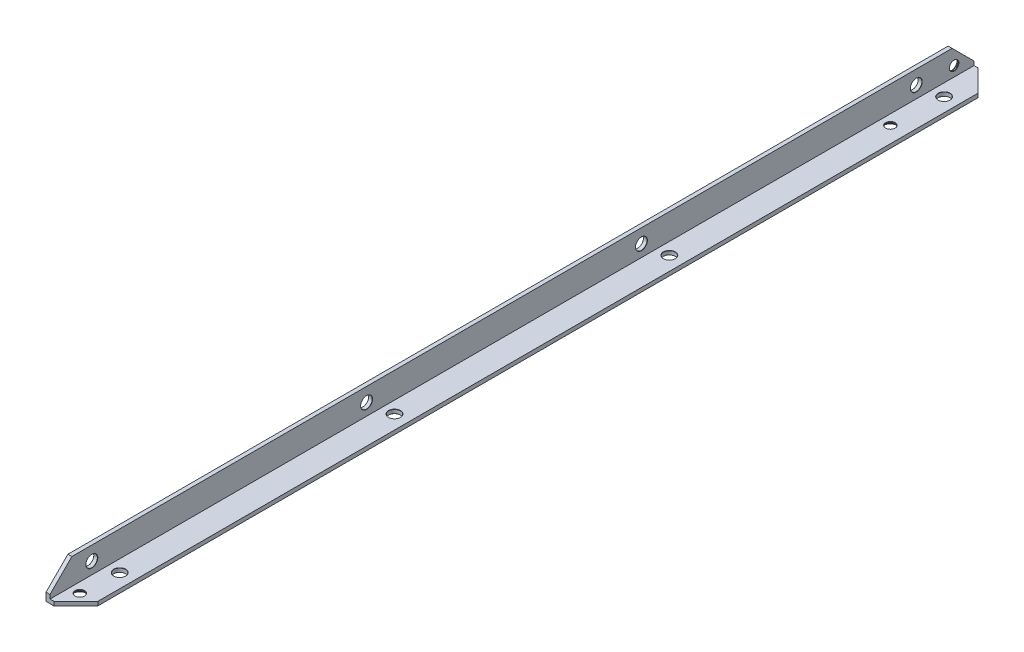
ISO-10303-21;
HEADER;
FILE_DESCRIPTION(('STEP AP214'),'2;1');
FILE_NAME('part.step','',(''),(''),'','','');
FILE_SCHEMA(('AUTOMOTIVE_DESIGN { 1 0 10303 214 1 1 1 1 }'));
ENDSEC;
DATA;
#1=APPLICATION_CONTEXT('core data for automotive mechanical design processes');
#2=APPLICATION_PROTOCOL_DEFINITION('international standard','automotive_design',2000,#1);
#3=PRODUCT_CONTEXT('',#1,'mechanical');
#4=PRODUCT('Part','Part','',(#3));
#5=PRODUCT_RELATED_PRODUCT_CATEGORY('part','',(#4));
#6=PRODUCT_DEFINITION_FORMATION('','',#4);
#7=PRODUCT_DEFINITION_CONTEXT('part definition',#1,'design');
#8=PRODUCT_DEFINITION('design','',#6,#7);
#9=PRODUCT_DEFINITION_SHAPE('','',#8);
#10=(LENGTH_UNIT() NAMED_UNIT(*) SI_UNIT(.MILLI.,.METRE.));
#11=(NAMED_UNIT(*) PLANE_ANGLE_UNIT() SI_UNIT($,.RADIAN.));
#12=(NAMED_UNIT(*) SI_UNIT($,.STERADIAN.) SOLID_ANGLE_UNIT());
#13=UNCERTAINTY_MEASURE_WITH_UNIT(LENGTH_MEASURE(1.E-05),#10,'distance_accuracy_value','');
#14=(GEOMETRIC_REPRESENTATION_CONTEXT(3) GLOBAL_UNCERTAINTY_ASSIGNED_CONTEXT((#13)) GLOBAL_UNIT_ASSIGNED_CONTEXT((#10,
#11,#12)) REPRESENTATION_CONTEXT('',''));
#15=CARTESIAN_POINT('',(0.,0.,0.));
#16=DIRECTION('',(0.,0.,1.));
#17=DIRECTION('',(1.,0.,0.));
#18=AXIS2_PLACEMENT_3D('',#15,#16,#17);
#19=CARTESIAN_POINT('',(15.,0.,464.));
#20=DIRECTION('',(0.,1.,0.));
#21=DIRECTION('',(-1.,0.,0.));
#22=AXIS2_PLACEMENT_3D('',#19,#20,#21);
#23=PLANE('',#22);
#24=CARTESIAN_POINT('',(8.00000000000016,0.,435.));
#25=DIRECTION('',(0.,-1.,0.));
#26=DIRECTION('',(0.,0.,-1.));
#27=AXIS2_PLACEMENT_3D('',#24,#25,#26);
#28=CIRCLE('',#27,3.);
#29=CARTESIAN_POINT('',(8.00000000000016,0.,432.));
#30=VERTEX_POINT('',#29);
#31=EDGE_CURVE('E288',#30,#30,#28,.T.);
#32=ORIENTED_EDGE('',*,*,#31,.F.);
#33=EDGE_LOOP('',(#32));
#34=FACE_BOUND('',#33,.T.);
#35=CARTESIAN_POINT('',(7.,0.,454.));
#36=DIRECTION('',(0.,-1.,0.));
#37=DIRECTION('',(0.,0.,-1.));
#38=AXIS2_PLACEMENT_3D('',#35,#36,#37);
#39=CIRCLE('',#38,3.7);
#40=CARTESIAN_POINT('',(7.,0.,450.3));
#41=VERTEX_POINT('',#40);
#42=EDGE_CURVE('E216',#41,#41,#39,.T.);
#43=ORIENTED_EDGE('',*,*,#42,.F.);
#44=EDGE_LOOP('',(#43));
#45=FACE_BOUND('',#44,.T.);
#46=CARTESIAN_POINT('',(7.,0.,47.));
#47=DIRECTION('',(0.,-1.,0.));
#48=DIRECTION('',(0.,0.,-1.));
#49=AXIS2_PLACEMENT_3D('',#46,#47,#48);
#50=CIRCLE('',#49,3.7);
#51=CARTESIAN_POINT('',(7.,0.,43.3));
#52=VERTEX_POINT('',#51);
#53=EDGE_CURVE('E204',#52,#52,#50,.T.);
#54=ORIENTED_EDGE('',*,*,#53,.F.);
#55=EDGE_LOOP('',(#54));
#56=FACE_BOUND('',#55,.T.);
#57=DIRECTION('',(1.,0.,0.));
#58=VECTOR('',#57,1.);
#59=CARTESIAN_POINT('',(15.,0.,0.));
#60=LINE('',#59,#58);
#61=CARTESIAN_POINT('',(0.,0.,0.));
#62=VERTEX_POINT('',#61);
#63=CARTESIAN_POINT('',(3.99999999999999,0.,0.));
#64=VERTEX_POINT('',#63);
#65=EDGE_CURVE('E142',#62,#64,#60,.T.);
#66=ORIENTED_EDGE('',*,*,#65,.T.);
#67=DIRECTION('',(0.707106781186547,0.,0.707106781186547));
#68=VECTOR('',#67,1.);
#69=CARTESIAN_POINT('',(15.,0.,11.));
#70=LINE('',#69,#68);
#71=CARTESIAN_POINT('',(15.,0.,10.9999999999999));
#72=VERTEX_POINT('',#71);
#73=EDGE_CURVE('E187',#64,#72,#70,.T.);
#74=ORIENTED_EDGE('',*,*,#73,.T.);
#75=DIRECTION('',(0.,0.,-1.));
#76=VECTOR('',#75,1.);
#77=CARTESIAN_POINT('',(15.,0.,464.));
#78=LINE('',#77,#76);
#79=CARTESIAN_POINT('',(15.,0.,453.));
#80=VERTEX_POINT('',#79);
#81=EDGE_CURVE('E159',#80,#72,#78,.T.);
#82=ORIENTED_EDGE('',*,*,#81,.F.);
#83=DIRECTION('',(0.707106781186547,0.,-0.707106781186547));
#84=VECTOR('',#83,1.);
#85=CARTESIAN_POINT('',(3.99999999999999,0.,464.));
#86=LINE('',#85,#84);
#87=CARTESIAN_POINT('',(3.99999999999999,0.,464.));
#88=VERTEX_POINT('',#87);
#89=EDGE_CURVE('E46',#80,#88,#86,.F.);
#90=ORIENTED_EDGE('',*,*,#89,.T.);
#91=DIRECTION('',(1.,0.,0.));
#92=VECTOR('',#91,1.);
#93=CARTESIAN_POINT('',(15.,0.,464.));
#94=LINE('',#93,#92);
#95=CARTESIAN_POINT('',(0.,0.,464.));
#96=VERTEX_POINT('',#95);
#97=EDGE_CURVE('E118',#96,#88,#94,.T.);
#98=ORIENTED_EDGE('',*,*,#97,.F.);
#99=DIRECTION('',(0.,0.,-1.));
#100=VECTOR('',#99,1.);
#101=CARTESIAN_POINT('',(0.,0.,464.));
#102=LINE('',#101,#100);
#103=EDGE_CURVE('E138',#96,#62,#102,.T.);
#104=ORIENTED_EDGE('',*,*,#103,.T.);
#105=EDGE_LOOP('',(#66,#74,#82,#90,#98,#104));
#106=FACE_BOUND('',#105,.T.);
#107=CARTESIAN_POINT('',(8.00000000000016,0.,297.));
#108=DIRECTION('',(0.,-1.,0.));
#109=DIRECTION('',(0.,0.,-1.));
#110=AXIS2_PLACEMENT_3D('',#107,#108,#109);
#111=CIRCLE('',#110,3.);
#112=CARTESIAN_POINT('',(8.00000000000016,0.,294.));
#113=VERTEX_POINT('',#112);
#114=EDGE_CURVE('E300',#113,#113,#111,.T.);
#115=ORIENTED_EDGE('',*,*,#114,.F.);
#116=EDGE_LOOP('',(#115));
#117=FACE_BOUND('',#116,.T.);
#118=CARTESIAN_POINT('',(8.00000000000015,0.,159.));
#119=DIRECTION('',(0.,-1.,0.));
#120=DIRECTION('',(0.,0.,-1.));
#121=AXIS2_PLACEMENT_3D('',#118,#119,#120);
#122=CIRCLE('',#121,3.);
#123=CARTESIAN_POINT('',(8.00000000000015,0.,156.));
#124=VERTEX_POINT('',#123);
#125=EDGE_CURVE('E312',#124,#124,#122,.T.);
#126=ORIENTED_EDGE('',*,*,#125,.F.);
#127=EDGE_LOOP('',(#126));
#128=FACE_BOUND('',#127,.T.);
#129=CARTESIAN_POINT('',(8.0000000000001,0.,21.0000000000003));
#130=DIRECTION('',(0.,-1.,0.));
#131=DIRECTION('',(0.,0.,-1.));
#132=AXIS2_PLACEMENT_3D('',#129,#130,#131);
#133=CIRCLE('',#132,3.);
#134=CARTESIAN_POINT('',(8.0000000000001,0.,18.0000000000003));
#135=VERTEX_POINT('',#134);
#136=EDGE_CURVE('E324',#135,#135,#133,.T.);
#137=ORIENTED_EDGE('',*,*,#136,.F.);
#138=EDGE_LOOP('',(#137));
#139=FACE_BOUND('',#138,.T.);
#140=ADVANCED_FACE('F31',(#34,#45,#56,#106,#117,#128,#139),#23,.F.);
#141=CARTESIAN_POINT('',(0.,0.,464.));
#142=DIRECTION('',(1.,0.,0.));
#143=DIRECTION('',(0.,0.,-1.));
#144=AXIS2_PLACEMENT_3D('',#141,#142,#143);
#145=PLANE('',#144);
#146=CARTESIAN_POINT('',(0.,7.99999999999996,167.));
#147=DIRECTION('',(-1.,0.,0.));
#148=DIRECTION('',(0.,0.,1.));
#149=AXIS2_PLACEMENT_3D('',#146,#147,#148);
#150=CIRCLE('',#149,3.);
#151=CARTESIAN_POINT('',(0.,7.99999999999996,170.));
#152=VERTEX_POINT('',#151);
#153=EDGE_CURVE('E264',#152,#152,#150,.T.);
#154=ORIENTED_EDGE('',*,*,#153,.F.);
#155=EDGE_LOOP('',(#154));
#156=FACE_BOUND('',#155,.T.);
#157=CARTESIAN_POINT('',(0.,7.99999999999996,443.));
#158=DIRECTION('',(-1.,0.,0.));
#159=DIRECTION('',(0.,0.,1.));
#160=AXIS2_PLACEMENT_3D('',#157,#158,#159);
#161=CIRCLE('',#160,3.);
#162=CARTESIAN_POINT('',(0.,7.99999999999996,446.));
#163=VERTEX_POINT('',#162);
#164=EDGE_CURVE('E240',#163,#163,#161,.T.);
#165=ORIENTED_EDGE('',*,*,#164,.F.);
#166=EDGE_LOOP('',(#165));
#167=FACE_BOUND('',#166,.T.);
#168=CARTESIAN_POINT('',(0.,7.00000000001343,9.99999999999908));
#169=DIRECTION('',(-1.,0.,0.));
#170=DIRECTION('',(0.,0.,1.));
#171=AXIS2_PLACEMENT_3D('',#168,#169,#170);
#172=CIRCLE('',#171,3.7);
#173=CARTESIAN_POINT('',(0.,7.00000000001343,13.6999999999991));
#174=VERTEX_POINT('',#173);
#175=EDGE_CURVE('E228',#174,#174,#172,.T.);
#176=ORIENTED_EDGE('',*,*,#175,.F.);
#177=EDGE_LOOP('',(#176));
#178=FACE_BOUND('',#177,.T.);
#179=DIRECTION('',(0.,0.,-1.));
#180=VECTOR('',#179,1.);
#181=CARTESIAN_POINT('',(0.,15.,464.));
#182=LINE('',#181,#180);
#183=CARTESIAN_POINT('',(0.,15.,453.));
#184=VERTEX_POINT('',#183);
#185=CARTESIAN_POINT('',(0.,15.,11.0000000000001));
#186=VERTEX_POINT('',#185);
#187=EDGE_CURVE('E153',#184,#186,#182,.T.);
#188=ORIENTED_EDGE('',*,*,#187,.T.);
#189=DIRECTION('',(0.,-0.707106781186548,-0.707106781186547));
#190=VECTOR('',#189,1.);
#191=CARTESIAN_POINT('',(0.,15.,11.));
#192=LINE('',#191,#190);
#193=CARTESIAN_POINT('',(0.,3.99999999999998,0.));
#194=VERTEX_POINT('',#193);
#195=EDGE_CURVE('E169',#186,#194,#192,.T.);
#196=ORIENTED_EDGE('',*,*,#195,.T.);
#197=DIRECTION('',(0.,-1.,0.));
#198=VECTOR('',#197,1.);
#199=CARTESIAN_POINT('',(0.,0.,0.));
#200=LINE('',#199,#198);
#201=EDGE_CURVE('E149',#194,#62,#200,.T.);
#202=ORIENTED_EDGE('',*,*,#201,.T.);
#203=ORIENTED_EDGE('',*,*,#103,.F.);
#204=DIRECTION('',(0.,-1.,0.));
#205=VECTOR('',#204,1.);
#206=CARTESIAN_POINT('',(0.,0.,464.));
#207=LINE('',#206,#205);
#208=CARTESIAN_POINT('',(0.,3.99999999999999,464.));
#209=VERTEX_POINT('',#208);
#210=EDGE_CURVE('E136',#209,#96,#207,.T.);
#211=ORIENTED_EDGE('',*,*,#210,.F.);
#212=DIRECTION('',(0.,-0.707106781186548,0.707106781186547));
#213=VECTOR('',#212,1.);
#214=CARTESIAN_POINT('',(0.,3.99999999999998,464.));
#215=LINE('',#214,#213);
#216=EDGE_CURVE('E167',#209,#184,#215,.F.);
#217=ORIENTED_EDGE('',*,*,#216,.T.);
#218=EDGE_LOOP('',(#188,#196,#202,#203,#211,#217));
#219=FACE_BOUND('',#218,.T.);
#220=CARTESIAN_POINT('',(0.,7.99999999999996,305.));
#221=DIRECTION('',(-1.,0.,0.));
#222=DIRECTION('',(0.,0.,1.));
#223=AXIS2_PLACEMENT_3D('',#220,#221,#222);
#224=CIRCLE('',#223,3.);
#225=CARTESIAN_POINT('',(0.,7.99999999999996,308.));
#226=VERTEX_POINT('',#225);
#227=EDGE_CURVE('E252',#226,#226,#224,.T.);
#228=ORIENTED_EDGE('',*,*,#227,.F.);
#229=EDGE_LOOP('',(#228));
#230=FACE_BOUND('',#229,.T.);
#231=CARTESIAN_POINT('',(0.,7.99999999999996,29.0000000000001));
#232=DIRECTION('',(-1.,0.,0.));
#233=DIRECTION('',(0.,0.,1.));
#234=AXIS2_PLACEMENT_3D('',#231,#232,#233);
#235=CIRCLE('',#234,3.);
#236=CARTESIAN_POINT('',(0.,7.99999999999996,32.0000000000001));
#237=VERTEX_POINT('',#236);
#238=EDGE_CURVE('E276',#237,#237,#235,.T.);
#239=ORIENTED_EDGE('',*,*,#238,.F.);
#240=EDGE_LOOP('',(#239));
#241=FACE_BOUND('',#240,.T.);
#242=ADVANCED_FACE('F192',(#156,#167,#178,#219,#230,#241),#145,.F.);
#243=CARTESIAN_POINT('',(15.,2.,464.));
#244=DIRECTION('',(-1.,0.,0.));
#245=DIRECTION('',(0.,-1.,0.));
#246=AXIS2_PLACEMENT_3D('',#243,#244,#245);
#247=PLANE('',#246);
#248=ORIENTED_EDGE('',*,*,#81,.T.);
#249=DIRECTION('',(0.,1.,0.));
#250=VECTOR('',#249,1.);
#251=CARTESIAN_POINT('',(15.,2.,11.));
#252=LINE('',#251,#250);
#253=CARTESIAN_POINT('',(15.,2.,11.0000000000001));
#254=VERTEX_POINT('',#253);
#255=EDGE_CURVE('E180',#72,#254,#252,.T.);
#256=ORIENTED_EDGE('',*,*,#255,.T.);
#257=DIRECTION('',(0.,0.,-1.));
#258=VECTOR('',#257,1.);
#259=CARTESIAN_POINT('',(15.,2.,464.));
#260=LINE('',#259,#258);
#261=CARTESIAN_POINT('',(15.,2.,453.));
#262=VERTEX_POINT('',#261);
#263=EDGE_CURVE('E129',#262,#254,#260,.T.);
#264=ORIENTED_EDGE('',*,*,#263,.F.);
#265=DIRECTION('',(0.,-1.,0.));
#266=VECTOR('',#265,1.);
#267=CARTESIAN_POINT('',(15.,2.,453.));
#268=LINE('',#267,#266);
#269=EDGE_CURVE('E178',#262,#80,#268,.T.);
#270=ORIENTED_EDGE('',*,*,#269,.T.);
#271=EDGE_LOOP('',(#248,#256,#264,#270));
#272=FACE_BOUND('',#271,.T.);
#273=ADVANCED_FACE('F358',(#272),#247,.F.);
#274=CARTESIAN_POINT('',(2.,2.,464.));
#275=DIRECTION('',(0.,-1.,0.));
#276=DIRECTION('',(0.,0.,-1.));
#277=AXIS2_PLACEMENT_3D('',#274,#275,#276);
#278=PLANE('',#277);
#279=CARTESIAN_POINT('',(8.0000000000001,2.,21.0000000000003));
#280=DIRECTION('',(0.,-1.,0.));
#281=DIRECTION('',(0.,0.,-1.));
#282=AXIS2_PLACEMENT_3D('',#279,#280,#281);
#283=CIRCLE('',#282,3.);
#284=CARTESIAN_POINT('',(8.0000000000001,2.,18.0000000000003));
#285=VERTEX_POINT('',#284);
#286=EDGE_CURVE('E327',#285,#285,#283,.T.);
#287=ORIENTED_EDGE('',*,*,#286,.T.);
#288=EDGE_LOOP('',(#287));
#289=FACE_BOUND('',#288,.T.);
#290=CARTESIAN_POINT('',(8.00000000000015,2.,159.));
#291=DIRECTION('',(0.,-1.,0.));
#292=DIRECTION('',(0.,0.,-1.));
#293=AXIS2_PLACEMENT_3D('',#290,#291,#292);
#294=CIRCLE('',#293,3.);
#295=CARTESIAN_POINT('',(8.00000000000015,2.,156.));
#296=VERTEX_POINT('',#295);
#297=EDGE_CURVE('E315',#296,#296,#294,.T.);
#298=ORIENTED_EDGE('',*,*,#297,.T.);
#299=EDGE_LOOP('',(#298));
#300=FACE_BOUND('',#299,.T.);
#301=CARTESIAN_POINT('',(8.00000000000016,2.,297.));
#302=DIRECTION('',(0.,-1.,0.));
#303=DIRECTION('',(0.,0.,-1.));
#304=AXIS2_PLACEMENT_3D('',#301,#302,#303);
#305=CIRCLE('',#304,3.);
#306=CARTESIAN_POINT('',(8.00000000000016,2.,294.));
#307=VERTEX_POINT('',#306);
#308=EDGE_CURVE('E303',#307,#307,#305,.T.);
#309=ORIENTED_EDGE('',*,*,#308,.T.);
#310=EDGE_LOOP('',(#309));
#311=FACE_BOUND('',#310,.T.);
#312=CARTESIAN_POINT('',(8.00000000000016,2.,435.));
#313=DIRECTION('',(0.,-1.,0.));
#314=DIRECTION('',(0.,0.,-1.));
#315=AXIS2_PLACEMENT_3D('',#312,#313,#314);
#316=CIRCLE('',#315,3.);
#317=CARTESIAN_POINT('',(8.00000000000016,2.,432.));
#318=VERTEX_POINT('',#317);
#319=EDGE_CURVE('E291',#318,#318,#316,.T.);
#320=ORIENTED_EDGE('',*,*,#319,.T.);
#321=EDGE_LOOP('',(#320));
#322=FACE_BOUND('',#321,.T.);
#323=CARTESIAN_POINT('',(7.,2.,454.));
#324=DIRECTION('',(0.,-1.,0.));
#325=DIRECTION('',(0.,0.,-1.));
#326=AXIS2_PLACEMENT_3D('',#323,#324,#325);
#327=CIRCLE('',#326,2.4);
#328=CARTESIAN_POINT('',(7.,2.,451.6));
#329=VERTEX_POINT('',#328);
#330=EDGE_CURVE('E219',#329,#329,#327,.T.);
#331=ORIENTED_EDGE('',*,*,#330,.T.);
#332=EDGE_LOOP('',(#331));
#333=FACE_BOUND('',#332,.T.);
#334=CARTESIAN_POINT('',(7.,2.,47.));
#335=DIRECTION('',(0.,-1.,0.));
#336=DIRECTION('',(0.,0.,-1.));
#337=AXIS2_PLACEMENT_3D('',#334,#335,#336);
#338=CIRCLE('',#337,2.4);
#339=CARTESIAN_POINT('',(7.,2.,44.6));
#340=VERTEX_POINT('',#339);
#341=EDGE_CURVE('E207',#340,#340,#338,.T.);
#342=ORIENTED_EDGE('',*,*,#341,.T.);
#343=EDGE_LOOP('',(#342));
#344=FACE_BOUND('',#343,.T.);
#345=ORIENTED_EDGE('',*,*,#263,.T.);
#346=DIRECTION('',(-0.707106781186548,0.,-0.707106781186548));
#347=VECTOR('',#346,1.);
#348=CARTESIAN_POINT('',(15.,2.,11.));
#349=LINE('',#348,#347);
#350=CARTESIAN_POINT('',(3.99999999999999,2.,0.));
#351=VERTEX_POINT('',#350);
#352=EDGE_CURVE('E184',#254,#351,#349,.T.);
#353=ORIENTED_EDGE('',*,*,#352,.T.);
#354=DIRECTION('',(-1.,0.,0.));
#355=VECTOR('',#354,1.);
#356=CARTESIAN_POINT('',(2.,2.,0.));
#357=LINE('',#356,#355);
#358=CARTESIAN_POINT('',(2.,2.,0.));
#359=VERTEX_POINT('',#358);
#360=EDGE_CURVE('E125',#351,#359,#357,.T.);
#361=ORIENTED_EDGE('',*,*,#360,.T.);
#362=DIRECTION('',(0.,0.,-1.));
#363=VECTOR('',#362,1.);
#364=CARTESIAN_POINT('',(2.,2.,464.));
#365=LINE('',#364,#363);
#366=CARTESIAN_POINT('',(2.,2.,464.));
#367=VERTEX_POINT('',#366);
#368=EDGE_CURVE('E121',#367,#359,#365,.T.);
#369=ORIENTED_EDGE('',*,*,#368,.F.);
#370=DIRECTION('',(-1.,0.,0.));
#371=VECTOR('',#370,1.);
#372=CARTESIAN_POINT('',(2.,2.,464.));
#373=LINE('',#372,#371);
#374=CARTESIAN_POINT('',(3.99999999999999,2.,464.));
#375=VERTEX_POINT('',#374);
#376=EDGE_CURVE('E110',#375,#367,#373,.T.);
#377=ORIENTED_EDGE('',*,*,#376,.F.);
#378=DIRECTION('',(-0.707106781186548,0.,0.707106781186548));
#379=VECTOR('',#378,1.);
#380=CARTESIAN_POINT('',(3.99999999999999,2.,464.));
#381=LINE('',#380,#379);
#382=EDGE_CURVE('E54',#375,#262,#381,.F.);
#383=ORIENTED_EDGE('',*,*,#382,.T.);
#384=EDGE_LOOP('',(#345,#353,#361,#369,#377,#383));
#385=FACE_BOUND('',#384,.T.);
#386=ADVANCED_FACE('F123',(#289,#300,#311,#322,#333,#344,#385),#278,.F.);
#387=CARTESIAN_POINT('',(2.,15.,464.));
#388=DIRECTION('',(-1.,0.,0.));
#389=DIRECTION('',(0.,-1.,0.));
#390=AXIS2_PLACEMENT_3D('',#387,#388,#389);
#391=PLANE('',#390);
#392=CARTESIAN_POINT('',(2.,7.99999999999996,29.0000000000001));
#393=DIRECTION('',(-1.,0.,0.));
#394=DIRECTION('',(0.,0.,1.));
#395=AXIS2_PLACEMENT_3D('',#392,#393,#394);
#396=CIRCLE('',#395,3.);
#397=CARTESIAN_POINT('',(2.,7.99999999999996,32.0000000000001));
#398=VERTEX_POINT('',#397);
#399=EDGE_CURVE('E279',#398,#398,#396,.T.);
#400=ORIENTED_EDGE('',*,*,#399,.T.);
#401=EDGE_LOOP('',(#400));
#402=FACE_BOUND('',#401,.T.);
#403=CARTESIAN_POINT('',(2.,7.99999999999996,167.));
#404=DIRECTION('',(-1.,0.,0.));
#405=DIRECTION('',(0.,0.,1.));
#406=AXIS2_PLACEMENT_3D('',#403,#404,#405);
#407=CIRCLE('',#406,3.);
#408=CARTESIAN_POINT('',(2.,7.99999999999996,170.));
#409=VERTEX_POINT('',#408);
#410=EDGE_CURVE('E267',#409,#409,#407,.T.);
#411=ORIENTED_EDGE('',*,*,#410,.T.);
#412=EDGE_LOOP('',(#411));
#413=FACE_BOUND('',#412,.T.);
#414=CARTESIAN_POINT('',(2.,7.99999999999996,305.));
#415=DIRECTION('',(-1.,0.,0.));
#416=DIRECTION('',(0.,0.,1.));
#417=AXIS2_PLACEMENT_3D('',#414,#415,#416);
#418=CIRCLE('',#417,3.);
#419=CARTESIAN_POINT('',(2.,7.99999999999996,308.));
#420=VERTEX_POINT('',#419);
#421=EDGE_CURVE('E255',#420,#420,#418,.T.);
#422=ORIENTED_EDGE('',*,*,#421,.T.);
#423=EDGE_LOOP('',(#422));
#424=FACE_BOUND('',#423,.T.);
#425=CARTESIAN_POINT('',(2.,7.99999999999996,443.));
#426=DIRECTION('',(-1.,0.,0.));
#427=DIRECTION('',(0.,0.,1.));
#428=AXIS2_PLACEMENT_3D('',#425,#426,#427);
#429=CIRCLE('',#428,3.);
#430=CARTESIAN_POINT('',(2.,7.99999999999996,446.));
#431=VERTEX_POINT('',#430);
#432=EDGE_CURVE('E243',#431,#431,#429,.T.);
#433=ORIENTED_EDGE('',*,*,#432,.T.);
#434=EDGE_LOOP('',(#433));
#435=FACE_BOUND('',#434,.T.);
#436=CARTESIAN_POINT('',(2.,7.00000000001343,9.99999999999908));
#437=DIRECTION('',(-1.,0.,0.));
#438=DIRECTION('',(0.,0.,1.));
#439=AXIS2_PLACEMENT_3D('',#436,#437,#438);
#440=CIRCLE('',#439,2.4);
#441=CARTESIAN_POINT('',(2.,7.00000000001343,12.3999999999991));
#442=VERTEX_POINT('',#441);
#443=EDGE_CURVE('E231',#442,#442,#440,.T.);
#444=ORIENTED_EDGE('',*,*,#443,.T.);
#445=EDGE_LOOP('',(#444));
#446=FACE_BOUND('',#445,.T.);
#447=DIRECTION('',(0.,1.,0.));
#448=VECTOR('',#447,1.);
#449=CARTESIAN_POINT('',(2.,15.,0.));
#450=LINE('',#449,#448);
#451=CARTESIAN_POINT('',(2.,3.99999999999999,0.));
#452=VERTEX_POINT('',#451);
#453=EDGE_CURVE('E147',#359,#452,#450,.T.);
#454=ORIENTED_EDGE('',*,*,#453,.T.);
#455=DIRECTION('',(0.,0.707106781186548,0.707106781186547));
#456=VECTOR('',#455,1.);
#457=CARTESIAN_POINT('',(2.,15.,11.));
#458=LINE('',#457,#456);
#459=CARTESIAN_POINT('',(2.,15.,11.0000000000001));
#460=VERTEX_POINT('',#459);
#461=EDGE_CURVE('E176',#452,#460,#458,.T.);
#462=ORIENTED_EDGE('',*,*,#461,.T.);
#463=DIRECTION('',(0.,0.,-1.));
#464=VECTOR('',#463,1.);
#465=CARTESIAN_POINT('',(2.,15.,464.));
#466=LINE('',#465,#464);
#467=CARTESIAN_POINT('',(2.,15.,453.));
#468=VERTEX_POINT('',#467);
#469=EDGE_CURVE('E130',#468,#460,#466,.T.);
#470=ORIENTED_EDGE('',*,*,#469,.F.);
#471=DIRECTION('',(0.,0.707106781186548,-0.707106781186547));
#472=VECTOR('',#471,1.);
#473=CARTESIAN_POINT('',(2.,3.99999999999999,464.));
#474=LINE('',#473,#472);
#475=CARTESIAN_POINT('',(2.,3.99999999999998,464.));
#476=VERTEX_POINT('',#475);
#477=EDGE_CURVE('E135',#468,#476,#474,.F.);
#478=ORIENTED_EDGE('',*,*,#477,.T.);
#479=DIRECTION('',(0.,1.,0.));
#480=VECTOR('',#479,1.);
#481=CARTESIAN_POINT('',(2.,15.,464.));
#482=LINE('',#481,#480);
#483=EDGE_CURVE('E115',#367,#476,#482,.T.);
#484=ORIENTED_EDGE('',*,*,#483,.F.);
#485=ORIENTED_EDGE('',*,*,#368,.T.);
#486=EDGE_LOOP('',(#454,#462,#470,#478,#484,#485));
#487=FACE_BOUND('',#486,.T.);
#488=ADVANCED_FACE('F132',(#402,#413,#424,#435,#446,#487),#391,.F.);
#489=CARTESIAN_POINT('',(0.,15.,464.));
#490=DIRECTION('',(0.,-1.,0.));
#491=DIRECTION('',(1.,0.,0.));
#492=AXIS2_PLACEMENT_3D('',#489,#490,#491);
#493=PLANE('',#492);
#494=ORIENTED_EDGE('',*,*,#469,.T.);
#495=DIRECTION('',(-1.,0.,0.));
#496=VECTOR('',#495,1.);
#497=CARTESIAN_POINT('',(0.,15.,11.));
#498=LINE('',#497,#496);
#499=EDGE_CURVE('E164',#460,#186,#498,.T.);
#500=ORIENTED_EDGE('',*,*,#499,.T.);
#501=ORIENTED_EDGE('',*,*,#187,.F.);
#502=DIRECTION('',(1.,0.,0.));
#503=VECTOR('',#502,1.);
#504=CARTESIAN_POINT('',(0.,15.,453.));
#505=LINE('',#504,#503);
#506=EDGE_CURVE('E162',#184,#468,#505,.T.);
#507=ORIENTED_EDGE('',*,*,#506,.T.);
#508=EDGE_LOOP('',(#494,#500,#501,#507));
#509=FACE_BOUND('',#508,.T.);
#510=ADVANCED_FACE('F390',(#509),#493,.F.);
#511=CARTESIAN_POINT('',(0.,0.,464.));
#512=DIRECTION('',(0.,0.,-1.));
#513=DIRECTION('',(-1.,0.,0.));
#514=AXIS2_PLACEMENT_3D('',#511,#512,#513);
#515=PLANE('',#514);
#516=ORIENTED_EDGE('',*,*,#97,.T.);
#517=DIRECTION('',(0.,1.,0.));
#518=VECTOR('',#517,1.);
#519=CARTESIAN_POINT('',(3.99999999999999,0.,464.));
#520=LINE('',#519,#518);
#521=EDGE_CURVE('E11',#88,#375,#520,.T.);
#522=ORIENTED_EDGE('',*,*,#521,.T.);
#523=ORIENTED_EDGE('',*,*,#376,.T.);
#524=ORIENTED_EDGE('',*,*,#483,.T.);
#525=DIRECTION('',(-1.,0.,0.));
#526=VECTOR('',#525,1.);
#527=CARTESIAN_POINT('',(0.,3.99999999999998,464.));
#528=LINE('',#527,#526);
#529=EDGE_CURVE('E39',#476,#209,#528,.T.);
#530=ORIENTED_EDGE('',*,*,#529,.T.);
#531=ORIENTED_EDGE('',*,*,#210,.T.);
#532=EDGE_LOOP('',(#516,#522,#523,#524,#530,#531));
#533=FACE_BOUND('',#532,.T.);
#534=ADVANCED_FACE('F112',(#533),#515,.F.);
#535=CARTESIAN_POINT('',(0.,0.,0.));
#536=DIRECTION('',(0.,0.,-1.));
#537=DIRECTION('',(-1.,0.,0.));
#538=AXIS2_PLACEMENT_3D('',#535,#536,#537);
#539=PLANE('',#538);
#540=ORIENTED_EDGE('',*,*,#201,.F.);
#541=DIRECTION('',(1.,0.,0.));
#542=VECTOR('',#541,1.);
#543=CARTESIAN_POINT('',(2.00000000000001,3.99999999999999,0.));
#544=LINE('',#543,#542);
#545=EDGE_CURVE('E173',#194,#452,#544,.T.);
#546=ORIENTED_EDGE('',*,*,#545,.T.);
#547=ORIENTED_EDGE('',*,*,#453,.F.);
#548=ORIENTED_EDGE('',*,*,#360,.F.);
#549=DIRECTION('',(0.,-1.,0.));
#550=VECTOR('',#549,1.);
#551=CARTESIAN_POINT('',(3.99999999999999,0.,0.));
#552=LINE('',#551,#550);
#553=EDGE_CURVE('E171',#351,#64,#552,.T.);
#554=ORIENTED_EDGE('',*,*,#553,.T.);
#555=ORIENTED_EDGE('',*,*,#65,.F.);
#556=EDGE_LOOP('',(#540,#546,#547,#548,#554,#555));
#557=FACE_BOUND('',#556,.T.);
#558=ADVANCED_FACE('F370',(#557),#539,.T.);
#559=CARTESIAN_POINT('',(0.,15.,11.));
#560=DIRECTION('',(0.,0.707106781186547,-0.707106781186548));
#561=DIRECTION('',(0.,0.707106781186548,0.707106781186547));
#562=AXIS2_PLACEMENT_3D('',#559,#560,#561);
#563=PLANE('',#562);
#564=ORIENTED_EDGE('',*,*,#461,.F.);
#565=ORIENTED_EDGE('',*,*,#545,.F.);
#566=ORIENTED_EDGE('',*,*,#195,.F.);
#567=ORIENTED_EDGE('',*,*,#499,.F.);
#568=EDGE_LOOP('',(#564,#565,#566,#567));
#569=FACE_BOUND('',#568,.T.);
#570=ADVANCED_FACE('F366',(#569),#563,.T.);
#571=CARTESIAN_POINT('',(15.,2.,11.));
#572=DIRECTION('',(0.707106781186547,0.,-0.707106781186547));
#573=DIRECTION('',(-0.707106781186548,0.,-0.707106781186548));
#574=AXIS2_PLACEMENT_3D('',#571,#572,#573);
#575=PLANE('',#574);
#576=ORIENTED_EDGE('',*,*,#73,.F.);
#577=ORIENTED_EDGE('',*,*,#553,.F.);
#578=ORIENTED_EDGE('',*,*,#352,.F.);
#579=ORIENTED_EDGE('',*,*,#255,.F.);
#580=EDGE_LOOP('',(#576,#577,#578,#579));
#581=FACE_BOUND('',#580,.T.);
#582=ADVANCED_FACE('F369',(#581),#575,.T.);
#583=CARTESIAN_POINT('',(3.99999999999999,0.,464.));
#584=DIRECTION('',(-0.707106781186547,0.,-0.707106781186547));
#585=DIRECTION('',(-0.707106781186548,0.,0.707106781186548));
#586=AXIS2_PLACEMENT_3D('',#583,#584,#585);
#587=PLANE('',#586);
#588=ORIENTED_EDGE('',*,*,#89,.F.);
#589=ORIENTED_EDGE('',*,*,#269,.F.);
#590=ORIENTED_EDGE('',*,*,#382,.F.);
#591=ORIENTED_EDGE('',*,*,#521,.F.);
#592=EDGE_LOOP('',(#588,#589,#590,#591));
#593=FACE_BOUND('',#592,.T.);
#594=ADVANCED_FACE('F373',(#593),#587,.F.);
#595=CARTESIAN_POINT('',(0.,3.99999999999998,464.));
#596=DIRECTION('',(0.,-0.707106781186547,-0.707106781186548));
#597=DIRECTION('',(0.,0.707106781186548,-0.707106781186547));
#598=AXIS2_PLACEMENT_3D('',#595,#596,#597);
#599=PLANE('',#598);
#600=ORIENTED_EDGE('',*,*,#477,.F.);
#601=ORIENTED_EDGE('',*,*,#506,.F.);
#602=ORIENTED_EDGE('',*,*,#216,.F.);
#603=ORIENTED_EDGE('',*,*,#529,.F.);
#604=EDGE_LOOP('',(#600,#601,#602,#603));
#605=FACE_BOUND('',#604,.T.);
#606=ADVANCED_FACE('F33',(#605),#599,.F.);
#607=CARTESIAN_POINT('',(7.,1.85,47.));
#608=DIRECTION('',(0.,1.,0.));
#609=DIRECTION('',(0.,0.,1.));
#610=AXIS2_PLACEMENT_3D('',#607,#608,#609);
#611=CONICAL_SURFACE('',#610,2.25,0.785398163397447);
#612=ORIENTED_EDGE('',*,*,#341,.F.);
#613=EDGE_LOOP('',(#612));
#614=FACE_BOUND('',#613,.T.);
#615=CARTESIAN_POINT('',(7.,1.85,47.));
#616=DIRECTION('',(0.,-1.,0.));
#617=DIRECTION('',(0.,0.,-1.));
#618=AXIS2_PLACEMENT_3D('',#615,#616,#617);
#619=CIRCLE('',#618,2.25);
#620=CARTESIAN_POINT('',(7.,1.85,44.75));
#621=VERTEX_POINT('',#620);
#622=EDGE_CURVE('E145',#621,#621,#619,.T.);
#623=ORIENTED_EDGE('',*,*,#622,.T.);
#624=EDGE_LOOP('',(#623));
#625=FACE_BOUND('',#624,.T.);
#626=ADVANCED_FACE('F379',(#614,#625),#611,.F.);
#627=CARTESIAN_POINT('',(7.,0.,47.));
#628=DIRECTION('',(0.,-1.,0.));
#629=DIRECTION('',(0.,0.,-1.));
#630=AXIS2_PLACEMENT_3D('',#627,#628,#629);
#631=CYLINDRICAL_SURFACE('',#630,2.25);
#632=ORIENTED_EDGE('',*,*,#622,.F.);
#633=EDGE_LOOP('',(#632));
#634=FACE_BOUND('',#633,.T.);
#635=CARTESIAN_POINT('',(7.,1.45,47.));
#636=DIRECTION('',(0.,-1.,0.));
#637=DIRECTION('',(0.,0.,-1.));
#638=AXIS2_PLACEMENT_3D('',#635,#636,#637);
#639=CIRCLE('',#638,2.25);
#640=CARTESIAN_POINT('',(7.,1.45,44.75));
#641=VERTEX_POINT('',#640);
#642=EDGE_CURVE('E201',#641,#641,#639,.T.);
#643=ORIENTED_EDGE('',*,*,#642,.T.);
#644=EDGE_LOOP('',(#643));
#645=FACE_BOUND('',#644,.T.);
#646=ADVANCED_FACE('F692',(#634,#645),#631,.F.);
#647=CARTESIAN_POINT('',(7.,0.,47.));
#648=DIRECTION('',(0.,-1.,0.));
#649=DIRECTION('',(0.,0.,-1.));
#650=AXIS2_PLACEMENT_3D('',#647,#648,#649);
#651=CONICAL_SURFACE('',#650,3.7,0.78539816339745);
#652=ORIENTED_EDGE('',*,*,#642,.F.);
#653=EDGE_LOOP('',(#652));
#654=FACE_BOUND('',#653,.T.);
#655=ORIENTED_EDGE('',*,*,#53,.T.);
#656=EDGE_LOOP('',(#655));
#657=FACE_BOUND('',#656,.T.);
#658=ADVANCED_FACE('F688',(#654,#657),#651,.F.);
#659=CARTESIAN_POINT('',(7.,1.85,454.));
#660=DIRECTION('',(0.,1.,0.));
#661=DIRECTION('',(0.,0.,1.));
#662=AXIS2_PLACEMENT_3D('',#659,#660,#661);
#663=CONICAL_SURFACE('',#662,2.25,0.785398163397447);
#664=ORIENTED_EDGE('',*,*,#330,.F.);
#665=EDGE_LOOP('',(#664));
#666=FACE_BOUND('',#665,.T.);
#667=CARTESIAN_POINT('',(7.,1.85,454.));
#668=DIRECTION('',(0.,-1.,0.));
#669=DIRECTION('',(0.,0.,-1.));
#670=AXIS2_PLACEMENT_3D('',#667,#668,#669);
#671=CIRCLE('',#670,2.25);
#672=CARTESIAN_POINT('',(7.,1.85,451.75));
#673=VERTEX_POINT('',#672);
#674=EDGE_CURVE('E210',#673,#673,#671,.T.);
#675=ORIENTED_EDGE('',*,*,#674,.T.);
#676=EDGE_LOOP('',(#675));
#677=FACE_BOUND('',#676,.T.);
#678=ADVANCED_FACE('F684',(#666,#677),#663,.F.);
#679=CARTESIAN_POINT('',(7.,0.,454.));
#680=DIRECTION('',(0.,-1.,0.));
#681=DIRECTION('',(0.,0.,-1.));
#682=AXIS2_PLACEMENT_3D('',#679,#680,#681);
#683=CYLINDRICAL_SURFACE('',#682,2.25);
#684=ORIENTED_EDGE('',*,*,#674,.F.);
#685=EDGE_LOOP('',(#684));
#686=FACE_BOUND('',#685,.T.);
#687=CARTESIAN_POINT('',(7.,1.45,454.));
#688=DIRECTION('',(0.,-1.,0.));
#689=DIRECTION('',(0.,0.,-1.));
#690=AXIS2_PLACEMENT_3D('',#687,#688,#689);
#691=CIRCLE('',#690,2.25);
#692=CARTESIAN_POINT('',(7.,1.45,451.75));
#693=VERTEX_POINT('',#692);
#694=EDGE_CURVE('E213',#693,#693,#691,.T.);
#695=ORIENTED_EDGE('',*,*,#694,.T.);
#696=EDGE_LOOP('',(#695));
#697=FACE_BOUND('',#696,.T.);
#698=ADVANCED_FACE('F680',(#686,#697),#683,.F.);
#699=CARTESIAN_POINT('',(7.,0.,454.));
#700=DIRECTION('',(0.,-1.,0.));
#701=DIRECTION('',(0.,0.,-1.));
#702=AXIS2_PLACEMENT_3D('',#699,#700,#701);
#703=CONICAL_SURFACE('',#702,3.7,0.78539816339745);
#704=ORIENTED_EDGE('',*,*,#694,.F.);
#705=EDGE_LOOP('',(#704));
#706=FACE_BOUND('',#705,.T.);
#707=ORIENTED_EDGE('',*,*,#42,.T.);
#708=EDGE_LOOP('',(#707));
#709=FACE_BOUND('',#708,.T.);
#710=ADVANCED_FACE('F676',(#706,#709),#703,.F.);
#711=CARTESIAN_POINT('',(1.85,7.00000000001343,9.99999999999908));
#712=DIRECTION('',(1.,0.,0.));
#713=DIRECTION('',(0.,0.,-1.));
#714=AXIS2_PLACEMENT_3D('',#711,#712,#713);
#715=CONICAL_SURFACE('',#714,2.25,0.785398163397448);
#716=ORIENTED_EDGE('',*,*,#443,.F.);
#717=EDGE_LOOP('',(#716));
#718=FACE_BOUND('',#717,.T.);
#719=CARTESIAN_POINT('',(1.85,7.00000000001343,9.99999999999908));
#720=DIRECTION('',(-1.,0.,0.));
#721=DIRECTION('',(0.,0.,1.));
#722=AXIS2_PLACEMENT_3D('',#719,#720,#721);
#723=CIRCLE('',#722,2.25);
#724=CARTESIAN_POINT('',(1.85,7.00000000001343,12.2499999999991));
#725=VERTEX_POINT('',#724);
#726=EDGE_CURVE('E222',#725,#725,#723,.T.);
#727=ORIENTED_EDGE('',*,*,#726,.T.);
#728=EDGE_LOOP('',(#727));
#729=FACE_BOUND('',#728,.T.);
#730=ADVANCED_FACE('F672',(#718,#729),#715,.F.);
#731=CARTESIAN_POINT('',(0.,7.00000000001343,9.99999999999908));
#732=DIRECTION('',(-1.,0.,0.));
#733=DIRECTION('',(0.,0.,1.));
#734=AXIS2_PLACEMENT_3D('',#731,#732,#733);
#735=CYLINDRICAL_SURFACE('',#734,2.24999999999999);
#736=ORIENTED_EDGE('',*,*,#726,.F.);
#737=EDGE_LOOP('',(#736));
#738=FACE_BOUND('',#737,.T.);
#739=CARTESIAN_POINT('',(1.44999999999999,7.00000000001343,9.99999999999908));
#740=DIRECTION('',(-1.,0.,0.));
#741=DIRECTION('',(0.,0.,1.));
#742=AXIS2_PLACEMENT_3D('',#739,#740,#741);
#743=CIRCLE('',#742,2.24999999999999);
#744=CARTESIAN_POINT('',(1.44999999999999,7.00000000001343,12.2499999999991));
#745=VERTEX_POINT('',#744);
#746=EDGE_CURVE('E225',#745,#745,#743,.T.);
#747=ORIENTED_EDGE('',*,*,#746,.T.);
#748=EDGE_LOOP('',(#747));
#749=FACE_BOUND('',#748,.T.);
#750=ADVANCED_FACE('F668',(#738,#749),#735,.F.);
#751=CARTESIAN_POINT('',(0.,7.00000000001343,9.99999999999908));
#752=DIRECTION('',(-1.,0.,0.));
#753=DIRECTION('',(0.,0.,1.));
#754=AXIS2_PLACEMENT_3D('',#751,#752,#753);
#755=CONICAL_SURFACE('',#754,3.7,0.785398163397455);
#756=ORIENTED_EDGE('',*,*,#746,.F.);
#757=EDGE_LOOP('',(#756));
#758=FACE_BOUND('',#757,.T.);
#759=ORIENTED_EDGE('',*,*,#175,.T.);
#760=EDGE_LOOP('',(#759));
#761=FACE_BOUND('',#760,.T.);
#762=ADVANCED_FACE('F420',(#758,#761),#755,.F.);
#763=CARTESIAN_POINT('',(1.9,7.99999999999996,443.));
#764=DIRECTION('',(1.,0.,0.));
#765=DIRECTION('',(0.,0.,-1.));
#766=AXIS2_PLACEMENT_3D('',#763,#764,#765);
#767=CONICAL_SURFACE('',#766,2.9,0.785398163397441);
#768=ORIENTED_EDGE('',*,*,#432,.F.);
#769=EDGE_LOOP('',(#768));
#770=FACE_BOUND('',#769,.T.);
#771=CARTESIAN_POINT('',(1.9,7.99999999999996,443.));
#772=DIRECTION('',(-1.,0.,0.));
#773=DIRECTION('',(0.,0.,1.));
#774=AXIS2_PLACEMENT_3D('',#771,#772,#773);
#775=CIRCLE('',#774,2.9);
#776=CARTESIAN_POINT('',(1.9,7.99999999999996,445.9));
#777=VERTEX_POINT('',#776);
#778=EDGE_CURVE('E234',#777,#777,#775,.T.);
#779=ORIENTED_EDGE('',*,*,#778,.T.);
#780=EDGE_LOOP('',(#779));
#781=FACE_BOUND('',#780,.T.);
#782=ADVANCED_FACE('F432',(#770,#781),#767,.F.);
#783=CARTESIAN_POINT('',(0.,7.99999999999996,443.));
#784=DIRECTION('',(-1.,0.,0.));
#785=DIRECTION('',(0.,0.,1.));
#786=AXIS2_PLACEMENT_3D('',#783,#784,#785);
#787=CYLINDRICAL_SURFACE('',#786,2.9);
#788=ORIENTED_EDGE('',*,*,#778,.F.);
#789=EDGE_LOOP('',(#788));
#790=FACE_BOUND('',#789,.T.);
#791=CARTESIAN_POINT('',(0.0999999999999998,7.99999999999996,443.));
#792=DIRECTION('',(-1.,0.,0.));
#793=DIRECTION('',(0.,0.,1.));
#794=AXIS2_PLACEMENT_3D('',#791,#792,#793);
#795=CIRCLE('',#794,2.9);
#796=CARTESIAN_POINT('',(0.0999999999999998,7.99999999999996,445.9));
#797=VERTEX_POINT('',#796);
#798=EDGE_CURVE('E237',#797,#797,#795,.T.);
#799=ORIENTED_EDGE('',*,*,#798,.T.);
#800=EDGE_LOOP('',(#799));
#801=FACE_BOUND('',#800,.T.);
#802=ADVANCED_FACE('F436',(#790,#801),#787,.F.);
#803=CARTESIAN_POINT('',(0.,7.99999999999996,443.));
#804=DIRECTION('',(-1.,0.,0.));
#805=DIRECTION('',(0.,0.,1.));
#806=AXIS2_PLACEMENT_3D('',#803,#804,#805);
#807=CONICAL_SURFACE('',#806,3.,0.785398163397446);
#808=ORIENTED_EDGE('',*,*,#798,.F.);
#809=EDGE_LOOP('',(#808));
#810=FACE_BOUND('',#809,.T.);
#811=ORIENTED_EDGE('',*,*,#164,.T.);
#812=EDGE_LOOP('',(#811));
#813=FACE_BOUND('',#812,.T.);
#814=ADVANCED_FACE('F446',(#810,#813),#807,.F.);
#815=CARTESIAN_POINT('',(1.9,7.99999999999996,305.));
#816=DIRECTION('',(1.,0.,0.));
#817=DIRECTION('',(0.,0.,-1.));
#818=AXIS2_PLACEMENT_3D('',#815,#816,#817);
#819=CONICAL_SURFACE('',#818,2.9,0.785398163397441);
#820=ORIENTED_EDGE('',*,*,#421,.F.);
#821=EDGE_LOOP('',(#820));
#822=FACE_BOUND('',#821,.T.);
#823=CARTESIAN_POINT('',(1.9,7.99999999999996,305.));
#824=DIRECTION('',(-1.,0.,0.));
#825=DIRECTION('',(0.,0.,1.));
#826=AXIS2_PLACEMENT_3D('',#823,#824,#825);
#827=CIRCLE('',#826,2.9);
#828=CARTESIAN_POINT('',(1.9,7.99999999999996,307.9));
#829=VERTEX_POINT('',#828);
#830=EDGE_CURVE('E246',#829,#829,#827,.T.);
#831=ORIENTED_EDGE('',*,*,#830,.T.);
#832=EDGE_LOOP('',(#831));
#833=FACE_BOUND('',#832,.T.);
#834=ADVANCED_FACE('F456',(#822,#833),#819,.F.);
#835=CARTESIAN_POINT('',(0.,7.99999999999996,305.));
#836=DIRECTION('',(-1.,0.,0.));
#837=DIRECTION('',(0.,0.,1.));
#838=AXIS2_PLACEMENT_3D('',#835,#836,#837);
#839=CYLINDRICAL_SURFACE('',#838,2.9);
#840=ORIENTED_EDGE('',*,*,#830,.F.);
#841=EDGE_LOOP('',(#840));
#842=FACE_BOUND('',#841,.T.);
#843=CARTESIAN_POINT('',(0.0999999999999998,7.99999999999996,305.));
#844=DIRECTION('',(-1.,0.,0.));
#845=DIRECTION('',(0.,0.,1.));
#846=AXIS2_PLACEMENT_3D('',#843,#844,#845);
#847=CIRCLE('',#846,2.9);
#848=CARTESIAN_POINT('',(0.0999999999999998,7.99999999999996,307.9));
#849=VERTEX_POINT('',#848);
#850=EDGE_CURVE('E249',#849,#849,#847,.T.);
#851=ORIENTED_EDGE('',*,*,#850,.T.);
#852=EDGE_LOOP('',(#851));
#853=FACE_BOUND('',#852,.T.);
#854=ADVANCED_FACE('F466',(#842,#853),#839,.F.);
#855=CARTESIAN_POINT('',(0.,7.99999999999996,305.));
#856=DIRECTION('',(-1.,0.,0.));
#857=DIRECTION('',(0.,0.,1.));
#858=AXIS2_PLACEMENT_3D('',#855,#856,#857);
#859=CONICAL_SURFACE('',#858,3.,0.785398163397446);
#860=ORIENTED_EDGE('',*,*,#850,.F.);
#861=EDGE_LOOP('',(#860));
#862=FACE_BOUND('',#861,.T.);
#863=ORIENTED_EDGE('',*,*,#227,.T.);
#864=EDGE_LOOP('',(#863));
#865=FACE_BOUND('',#864,.T.);
#866=ADVANCED_FACE('F476',(#862,#865),#859,.F.);
#867=CARTESIAN_POINT('',(1.9,7.99999999999996,167.));
#868=DIRECTION('',(1.,0.,0.));
#869=DIRECTION('',(0.,0.,-1.));
#870=AXIS2_PLACEMENT_3D('',#867,#868,#869);
#871=CONICAL_SURFACE('',#870,2.9,0.785398163397441);
#872=ORIENTED_EDGE('',*,*,#410,.F.);
#873=EDGE_LOOP('',(#872));
#874=FACE_BOUND('',#873,.T.);
#875=CARTESIAN_POINT('',(1.9,7.99999999999996,167.));
#876=DIRECTION('',(-1.,0.,0.));
#877=DIRECTION('',(0.,0.,1.));
#878=AXIS2_PLACEMENT_3D('',#875,#876,#877);
#879=CIRCLE('',#878,2.9);
#880=CARTESIAN_POINT('',(1.9,7.99999999999996,169.9));
#881=VERTEX_POINT('',#880);
#882=EDGE_CURVE('E258',#881,#881,#879,.T.);
#883=ORIENTED_EDGE('',*,*,#882,.T.);
#884=EDGE_LOOP('',(#883));
#885=FACE_BOUND('',#884,.T.);
#886=ADVANCED_FACE('F486',(#874,#885),#871,.F.);
#887=CARTESIAN_POINT('',(0.,7.99999999999996,167.));
#888=DIRECTION('',(-1.,0.,0.));
#889=DIRECTION('',(0.,0.,1.));
#890=AXIS2_PLACEMENT_3D('',#887,#888,#889);
#891=CYLINDRICAL_SURFACE('',#890,2.9);
#892=ORIENTED_EDGE('',*,*,#882,.F.);
#893=EDGE_LOOP('',(#892));
#894=FACE_BOUND('',#893,.T.);
#895=CARTESIAN_POINT('',(0.0999999999999998,7.99999999999996,167.));
#896=DIRECTION('',(-1.,0.,0.));
#897=DIRECTION('',(0.,0.,1.));
#898=AXIS2_PLACEMENT_3D('',#895,#896,#897);
#899=CIRCLE('',#898,2.9);
#900=CARTESIAN_POINT('',(0.0999999999999998,7.99999999999996,169.9));
#901=VERTEX_POINT('',#900);
#902=EDGE_CURVE('E261',#901,#901,#899,.T.);
#903=ORIENTED_EDGE('',*,*,#902,.T.);
#904=EDGE_LOOP('',(#903));
#905=FACE_BOUND('',#904,.T.);
#906=ADVANCED_FACE('F496',(#894,#905),#891,.F.);
#907=CARTESIAN_POINT('',(0.,7.99999999999996,167.));
#908=DIRECTION('',(-1.,0.,0.));
#909=DIRECTION('',(0.,0.,1.));
#910=AXIS2_PLACEMENT_3D('',#907,#908,#909);
#911=CONICAL_SURFACE('',#910,3.,0.785398163397446);
#912=ORIENTED_EDGE('',*,*,#902,.F.);
#913=EDGE_LOOP('',(#912));
#914=FACE_BOUND('',#913,.T.);
#915=ORIENTED_EDGE('',*,*,#153,.T.);
#916=EDGE_LOOP('',(#915));
#917=FACE_BOUND('',#916,.T.);
#918=ADVANCED_FACE('F506',(#914,#917),#911,.F.);
#919=CARTESIAN_POINT('',(1.9,7.99999999999996,29.0000000000001));
#920=DIRECTION('',(1.,0.,0.));
#921=DIRECTION('',(0.,0.,-1.));
#922=AXIS2_PLACEMENT_3D('',#919,#920,#921);
#923=CONICAL_SURFACE('',#922,2.9,0.785398163397441);
#924=ORIENTED_EDGE('',*,*,#399,.F.);
#925=EDGE_LOOP('',(#924));
#926=FACE_BOUND('',#925,.T.);
#927=CARTESIAN_POINT('',(1.9,7.99999999999996,29.0000000000001));
#928=DIRECTION('',(-1.,0.,0.));
#929=DIRECTION('',(0.,0.,1.));
#930=AXIS2_PLACEMENT_3D('',#927,#928,#929);
#931=CIRCLE('',#930,2.9);
#932=CARTESIAN_POINT('',(1.9,7.99999999999996,31.9000000000001));
#933=VERTEX_POINT('',#932);
#934=EDGE_CURVE('E270',#933,#933,#931,.T.);
#935=ORIENTED_EDGE('',*,*,#934,.T.);
#936=EDGE_LOOP('',(#935));
#937=FACE_BOUND('',#936,.T.);
#938=ADVANCED_FACE('F516',(#926,#937),#923,.F.);
#939=CARTESIAN_POINT('',(0.,7.99999999999996,29.0000000000001));
#940=DIRECTION('',(-1.,0.,0.));
#941=DIRECTION('',(0.,0.,1.));
#942=AXIS2_PLACEMENT_3D('',#939,#940,#941);
#943=CYLINDRICAL_SURFACE('',#942,2.9);
#944=ORIENTED_EDGE('',*,*,#934,.F.);
#945=EDGE_LOOP('',(#944));
#946=FACE_BOUND('',#945,.T.);
#947=CARTESIAN_POINT('',(0.0999999999999998,7.99999999999996,29.0000000000001));
#948=DIRECTION('',(-1.,0.,0.));
#949=DIRECTION('',(0.,0.,1.));
#950=AXIS2_PLACEMENT_3D('',#947,#948,#949);
#951=CIRCLE('',#950,2.9);
#952=CARTESIAN_POINT('',(0.0999999999999998,7.99999999999996,31.9000000000001));
#953=VERTEX_POINT('',#952);
#954=EDGE_CURVE('E273',#953,#953,#951,.T.);
#955=ORIENTED_EDGE('',*,*,#954,.T.);
#956=EDGE_LOOP('',(#955));
#957=FACE_BOUND('',#956,.T.);
#958=ADVANCED_FACE('F526',(#946,#957),#943,.F.);
#959=CARTESIAN_POINT('',(0.,7.99999999999996,29.0000000000001));
#960=DIRECTION('',(-1.,0.,0.));
#961=DIRECTION('',(0.,0.,1.));
#962=AXIS2_PLACEMENT_3D('',#959,#960,#961);
#963=CONICAL_SURFACE('',#962,3.,0.785398163397446);
#964=ORIENTED_EDGE('',*,*,#954,.F.);
#965=EDGE_LOOP('',(#964));
#966=FACE_BOUND('',#965,.T.);
#967=ORIENTED_EDGE('',*,*,#238,.T.);
#968=EDGE_LOOP('',(#967));
#969=FACE_BOUND('',#968,.T.);
#970=ADVANCED_FACE('F536',(#966,#969),#963,.F.);
#971=CARTESIAN_POINT('',(8.00000000000016,1.9,435.));
#972=DIRECTION('',(0.,1.,0.));
#973=DIRECTION('',(0.,0.,1.));
#974=AXIS2_PLACEMENT_3D('',#971,#972,#973);
#975=CONICAL_SURFACE('',#974,2.9,0.78539816339744);
#976=ORIENTED_EDGE('',*,*,#319,.F.);
#977=EDGE_LOOP('',(#976));
#978=FACE_BOUND('',#977,.T.);
#979=CARTESIAN_POINT('',(8.00000000000016,1.9,435.));
#980=DIRECTION('',(0.,-1.,0.));
#981=DIRECTION('',(0.,0.,-1.));
#982=AXIS2_PLACEMENT_3D('',#979,#980,#981);
#983=CIRCLE('',#982,2.9);
#984=CARTESIAN_POINT('',(8.00000000000016,1.9,432.1));
#985=VERTEX_POINT('',#984);
#986=EDGE_CURVE('E282',#985,#985,#983,.T.);
#987=ORIENTED_EDGE('',*,*,#986,.T.);
#988=EDGE_LOOP('',(#987));
#989=FACE_BOUND('',#988,.T.);
#990=ADVANCED_FACE('F545',(#978,#989),#975,.F.);
#991=CARTESIAN_POINT('',(8.00000000000016,0.,435.));
#992=DIRECTION('',(0.,-1.,0.));
#993=DIRECTION('',(0.,0.,-1.));
#994=AXIS2_PLACEMENT_3D('',#991,#992,#993);
#995=CYLINDRICAL_SURFACE('',#994,2.9);
#996=ORIENTED_EDGE('',*,*,#986,.F.);
#997=EDGE_LOOP('',(#996));
#998=FACE_BOUND('',#997,.T.);
#999=CARTESIAN_POINT('',(8.00000000000016,0.0999999999999998,435.));
#1000=DIRECTION('',(0.,-1.,0.));
#1001=DIRECTION('',(0.,0.,-1.));
#1002=AXIS2_PLACEMENT_3D('',#999,#1000,#1001);
#1003=CIRCLE('',#1002,2.9);
#1004=CARTESIAN_POINT('',(8.00000000000016,0.0999999999999998,432.1));
#1005=VERTEX_POINT('',#1004);
#1006=EDGE_CURVE('E285',#1005,#1005,#1003,.T.);
#1007=ORIENTED_EDGE('',*,*,#1006,.T.);
#1008=EDGE_LOOP('',(#1007));
#1009=FACE_BOUND('',#1008,.T.);
#1010=ADVANCED_FACE('F563',(#998,#1009),#995,.F.);
#1011=CARTESIAN_POINT('',(8.00000000000016,0.,435.));
#1012=DIRECTION('',(0.,-1.,0.));
#1013=DIRECTION('',(0.,0.,-1.));
#1014=AXIS2_PLACEMENT_3D('',#1011,#1012,#1013);
#1015=CONICAL_SURFACE('',#1014,3.,0.785398163397446);
#1016=ORIENTED_EDGE('',*,*,#1006,.F.);
#1017=EDGE_LOOP('',(#1016));
#1018=FACE_BOUND('',#1017,.T.);
#1019=ORIENTED_EDGE('',*,*,#31,.T.);
#1020=EDGE_LOOP('',(#1019));
#1021=FACE_BOUND('',#1020,.T.);
#1022=ADVANCED_FACE('F573',(#1018,#1021),#1015,.F.);
#1023=CARTESIAN_POINT('',(8.00000000000016,1.9,297.));
#1024=DIRECTION('',(0.,1.,0.));
#1025=DIRECTION('',(0.,0.,1.));
#1026=AXIS2_PLACEMENT_3D('',#1023,#1024,#1025);
#1027=CONICAL_SURFACE('',#1026,2.9,0.78539816339744);
#1028=ORIENTED_EDGE('',*,*,#308,.F.);
#1029=EDGE_LOOP('',(#1028));
#1030=FACE_BOUND('',#1029,.T.);
#1031=CARTESIAN_POINT('',(8.00000000000016,1.9,297.));
#1032=DIRECTION('',(0.,-1.,0.));
#1033=DIRECTION('',(0.,0.,-1.));
#1034=AXIS2_PLACEMENT_3D('',#1031,#1032,#1033);
#1035=CIRCLE('',#1034,2.9);
#1036=CARTESIAN_POINT('',(8.00000000000016,1.9,294.1));
#1037=VERTEX_POINT('',#1036);
#1038=EDGE_CURVE('E294',#1037,#1037,#1035,.T.);
#1039=ORIENTED_EDGE('',*,*,#1038,.T.);
#1040=EDGE_LOOP('',(#1039));
#1041=FACE_BOUND('',#1040,.T.);
#1042=ADVANCED_FACE('F583',(#1030,#1041),#1027,.F.);
#1043=CARTESIAN_POINT('',(8.00000000000016,0.,297.));
#1044=DIRECTION('',(0.,-1.,0.));
#1045=DIRECTION('',(0.,0.,-1.));
#1046=AXIS2_PLACEMENT_3D('',#1043,#1044,#1045);
#1047=CYLINDRICAL_SURFACE('',#1046,2.9);
#1048=ORIENTED_EDGE('',*,*,#1038,.F.);
#1049=EDGE_LOOP('',(#1048));
#1050=FACE_BOUND('',#1049,.T.);
#1051=CARTESIAN_POINT('',(8.00000000000016,0.0999999999999998,297.));
#1052=DIRECTION('',(0.,-1.,0.));
#1053=DIRECTION('',(0.,0.,-1.));
#1054=AXIS2_PLACEMENT_3D('',#1051,#1052,#1053);
#1055=CIRCLE('',#1054,2.9);
#1056=CARTESIAN_POINT('',(8.00000000000016,0.0999999999999998,294.1));
#1057=VERTEX_POINT('',#1056);
#1058=EDGE_CURVE('E297',#1057,#1057,#1055,.T.);
#1059=ORIENTED_EDGE('',*,*,#1058,.T.);
#1060=EDGE_LOOP('',(#1059));
#1061=FACE_BOUND('',#1060,.T.);
#1062=ADVANCED_FACE('F593',(#1050,#1061),#1047,.F.);
#1063=CARTESIAN_POINT('',(8.00000000000016,0.,297.));
#1064=DIRECTION('',(0.,-1.,0.));
#1065=DIRECTION('',(0.,0.,-1.));
#1066=AXIS2_PLACEMENT_3D('',#1063,#1064,#1065);
#1067=CONICAL_SURFACE('',#1066,3.,0.785398163397455);
#1068=ORIENTED_EDGE('',*,*,#1058,.F.);
#1069=EDGE_LOOP('',(#1068));
#1070=FACE_BOUND('',#1069,.T.);
#1071=ORIENTED_EDGE('',*,*,#114,.T.);
#1072=EDGE_LOOP('',(#1071));
#1073=FACE_BOUND('',#1072,.T.);
#1074=ADVANCED_FACE('F603',(#1070,#1073),#1067,.F.);
#1075=CARTESIAN_POINT('',(8.00000000000015,1.9,159.));
#1076=DIRECTION('',(0.,1.,0.));
#1077=DIRECTION('',(0.,0.,1.));
#1078=AXIS2_PLACEMENT_3D('',#1075,#1076,#1077);
#1079=CONICAL_SURFACE('',#1078,2.9,0.78539816339744);
#1080=ORIENTED_EDGE('',*,*,#297,.F.);
#1081=EDGE_LOOP('',(#1080));
#1082=FACE_BOUND('',#1081,.T.);
#1083=CARTESIAN_POINT('',(8.00000000000015,1.9,159.));
#1084=DIRECTION('',(0.,-1.,0.));
#1085=DIRECTION('',(0.,0.,-1.));
#1086=AXIS2_PLACEMENT_3D('',#1083,#1084,#1085);
#1087=CIRCLE('',#1086,2.9);
#1088=CARTESIAN_POINT('',(8.00000000000015,1.9,156.1));
#1089=VERTEX_POINT('',#1088);
#1090=EDGE_CURVE('E306',#1089,#1089,#1087,.T.);
#1091=ORIENTED_EDGE('',*,*,#1090,.T.);
#1092=EDGE_LOOP('',(#1091));
#1093=FACE_BOUND('',#1092,.T.);
#1094=ADVANCED_FACE('F613',(#1082,#1093),#1079,.F.);
#1095=CARTESIAN_POINT('',(8.00000000000015,0.,159.));
#1096=DIRECTION('',(0.,-1.,0.));
#1097=DIRECTION('',(0.,0.,-1.));
#1098=AXIS2_PLACEMENT_3D('',#1095,#1096,#1097);
#1099=CYLINDRICAL_SURFACE('',#1098,2.9);
#1100=ORIENTED_EDGE('',*,*,#1090,.F.);
#1101=EDGE_LOOP('',(#1100));
#1102=FACE_BOUND('',#1101,.T.);
#1103=CARTESIAN_POINT('',(8.00000000000015,0.0999999999999998,159.));
#1104=DIRECTION('',(0.,-1.,0.));
#1105=DIRECTION('',(0.,0.,-1.));
#1106=AXIS2_PLACEMENT_3D('',#1103,#1104,#1105);
#1107=CIRCLE('',#1106,2.9);
#1108=CARTESIAN_POINT('',(8.00000000000015,0.0999999999999998,156.1));
#1109=VERTEX_POINT('',#1108);
#1110=EDGE_CURVE('E309',#1109,#1109,#1107,.T.);
#1111=ORIENTED_EDGE('',*,*,#1110,.T.);
#1112=EDGE_LOOP('',(#1111));
#1113=FACE_BOUND('',#1112,.T.);
#1114=ADVANCED_FACE('F623',(#1102,#1113),#1099,.F.);
#1115=CARTESIAN_POINT('',(8.00000000000015,0.,159.));
#1116=DIRECTION('',(0.,-1.,0.));
#1117=DIRECTION('',(0.,0.,-1.));
#1118=AXIS2_PLACEMENT_3D('',#1115,#1116,#1117);
#1119=CONICAL_SURFACE('',#1118,3.,0.785398163397455);
#1120=ORIENTED_EDGE('',*,*,#1110,.F.);
#1121=EDGE_LOOP('',(#1120));
#1122=FACE_BOUND('',#1121,.T.);
#1123=ORIENTED_EDGE('',*,*,#125,.T.);
#1124=EDGE_LOOP('',(#1123));
#1125=FACE_BOUND('',#1124,.T.);
#1126=ADVANCED_FACE('F337',(#1122,#1125),#1119,.F.);
#1127=CARTESIAN_POINT('',(8.0000000000001,1.9,21.0000000000003));
#1128=DIRECTION('',(0.,1.,0.));
#1129=DIRECTION('',(0.,0.,1.));
#1130=AXIS2_PLACEMENT_3D('',#1127,#1128,#1129);
#1131=CONICAL_SURFACE('',#1130,2.9,0.78539816339744);
#1132=ORIENTED_EDGE('',*,*,#286,.F.);
#1133=EDGE_LOOP('',(#1132));
#1134=FACE_BOUND('',#1133,.T.);
#1135=CARTESIAN_POINT('',(8.0000000000001,1.9,21.0000000000003));
#1136=DIRECTION('',(0.,-1.,0.));
#1137=DIRECTION('',(0.,0.,-1.));
#1138=AXIS2_PLACEMENT_3D('',#1135,#1136,#1137);
#1139=CIRCLE('',#1138,2.9);
#1140=CARTESIAN_POINT('',(8.0000000000001,1.9,18.1000000000003));
#1141=VERTEX_POINT('',#1140);
#1142=EDGE_CURVE('E318',#1141,#1141,#1139,.T.);
#1143=ORIENTED_EDGE('',*,*,#1142,.T.);
#1144=EDGE_LOOP('',(#1143));
#1145=FACE_BOUND('',#1144,.T.);
#1146=ADVANCED_FACE('F333',(#1134,#1145),#1131,.F.);
#1147=CARTESIAN_POINT('',(8.0000000000001,0.,21.0000000000003));
#1148=DIRECTION('',(0.,-1.,0.));
#1149=DIRECTION('',(0.,0.,-1.));
#1150=AXIS2_PLACEMENT_3D('',#1147,#1148,#1149);
#1151=CYLINDRICAL_SURFACE('',#1150,2.9);
#1152=ORIENTED_EDGE('',*,*,#1142,.F.);
#1153=EDGE_LOOP('',(#1152));
#1154=FACE_BOUND('',#1153,.T.);
#1155=CARTESIAN_POINT('',(8.0000000000001,0.0999999999999998,21.0000000000003));
#1156=DIRECTION('',(0.,-1.,0.));
#1157=DIRECTION('',(0.,0.,-1.));
#1158=AXIS2_PLACEMENT_3D('',#1155,#1156,#1157);
#1159=CIRCLE('',#1158,2.9);
#1160=CARTESIAN_POINT('',(8.0000000000001,0.0999999999999998,18.1000000000003));
#1161=VERTEX_POINT('',#1160);
#1162=EDGE_CURVE('E321',#1161,#1161,#1159,.T.);
#1163=ORIENTED_EDGE('',*,*,#1162,.T.);
#1164=EDGE_LOOP('',(#1163));
#1165=FACE_BOUND('',#1164,.T.);
#1166=ADVANCED_FACE('F336',(#1154,#1165),#1151,.F.);
#1167=CARTESIAN_POINT('',(8.0000000000001,0.,21.0000000000003));
#1168=DIRECTION('',(0.,-1.,0.));
#1169=DIRECTION('',(0.,0.,-1.));
#1170=AXIS2_PLACEMENT_3D('',#1167,#1168,#1169);
#1171=CONICAL_SURFACE('',#1170,3.,0.785398163397455);
#1172=ORIENTED_EDGE('',*,*,#1162,.F.);
#1173=EDGE_LOOP('',(#1172));
#1174=FACE_BOUND('',#1173,.T.);
#1175=ORIENTED_EDGE('',*,*,#136,.T.);
#1176=EDGE_LOOP('',(#1175));
#1177=FACE_BOUND('',#1176,.T.);
#1178=ADVANCED_FACE('F343',(#1174,#1177),#1171,.F.);
#1179=CLOSED_SHELL('',(#140,#242,#273,#386,#488,#510,#534,#558,#570,#582,#594,#606,#626,#646,
#658,#678,#698,#710,#730,#750,#762,#782,#802,#814,#834,#854,#866,#886,#906,#918,#938,#958,#970,
#990,#1010,#1022,#1042,#1062,#1074,#1094,#1114,#1126,#1146,#1166,#1178));
#1180=MANIFOLD_SOLID_BREP('B2',#1179);
#1181=ADVANCED_BREP_SHAPE_REPRESENTATION('',(#18,#1180),#14);
#1182=SHAPE_DEFINITION_REPRESENTATION(#9,#1181);
ENDSEC;
END-ISO-10303-21;
